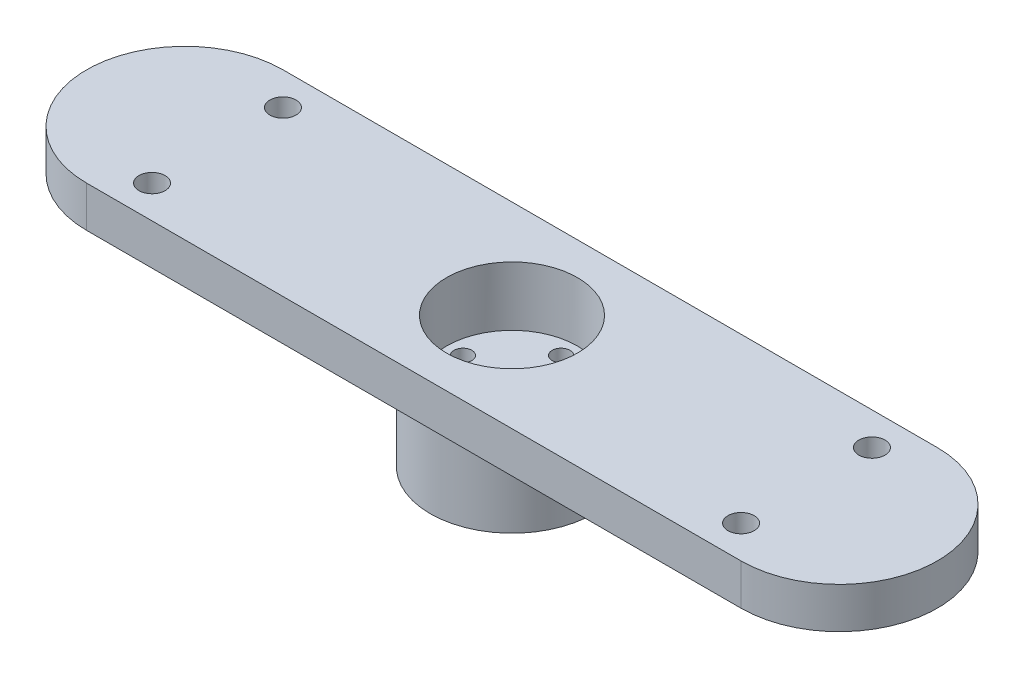
ISO-10303-21;
HEADER;
FILE_DESCRIPTION(('STEP AP214'),'2;1');
FILE_NAME('part.step','',(''),(''),'','','');
FILE_SCHEMA(('AUTOMOTIVE_DESIGN { 1 0 10303 214 1 1 1 1 }'));
ENDSEC;
DATA;
#1=APPLICATION_CONTEXT('core data for automotive mechanical design processes');
#2=APPLICATION_PROTOCOL_DEFINITION('international standard','automotive_design',2000,#1);
#3=PRODUCT_CONTEXT('',#1,'mechanical');
#4=PRODUCT('Part','Part','',(#3));
#5=PRODUCT_RELATED_PRODUCT_CATEGORY('part','',(#4));
#6=PRODUCT_DEFINITION_FORMATION('','',#4);
#7=PRODUCT_DEFINITION_CONTEXT('part definition',#1,'design');
#8=PRODUCT_DEFINITION('design','',#6,#7);
#9=PRODUCT_DEFINITION_SHAPE('','',#8);
#10=(LENGTH_UNIT() NAMED_UNIT(*) SI_UNIT(.MILLI.,.METRE.));
#11=(NAMED_UNIT(*) PLANE_ANGLE_UNIT() SI_UNIT($,.RADIAN.));
#12=(NAMED_UNIT(*) SI_UNIT($,.STERADIAN.) SOLID_ANGLE_UNIT());
#13=UNCERTAINTY_MEASURE_WITH_UNIT(LENGTH_MEASURE(1.E-05),#10,'distance_accuracy_value','');
#14=(GEOMETRIC_REPRESENTATION_CONTEXT(3) GLOBAL_UNCERTAINTY_ASSIGNED_CONTEXT((#13)) GLOBAL_UNIT_ASSIGNED_CONTEXT((#10,
#11,#12)) REPRESENTATION_CONTEXT('',''));
#15=CARTESIAN_POINT('',(0.,0.,0.));
#16=DIRECTION('',(0.,0.,1.));
#17=DIRECTION('',(1.,0.,0.));
#18=AXIS2_PLACEMENT_3D('',#15,#16,#17);
#19=CARTESIAN_POINT('',(0.,25.4,0.));
#20=DIRECTION('',(0.,-1.,0.));
#21=DIRECTION('',(0.,0.,-1.));
#22=AXIS2_PLACEMENT_3D('',#19,#20,#21);
#23=CYLINDRICAL_SURFACE('',#22,15.875);
#24=CARTESIAN_POINT('',(0.,15.0698,0.));
#25=DIRECTION('',(0.,1.,0.));
#26=DIRECTION('',(0.,0.,1.));
#27=AXIS2_PLACEMENT_3D('',#24,#25,#26);
#28=CIRCLE('',#27,15.875);
#29=CARTESIAN_POINT('',(0.,15.0698,15.875));
#30=VERTEX_POINT('',#29);
#31=EDGE_CURVE('E11',#30,#30,#28,.F.);
#32=ORIENTED_EDGE('',*,*,#31,.T.);
#33=EDGE_LOOP('',(#32));
#34=FACE_BOUND('',#33,.T.);
#35=CARTESIAN_POINT('',(0.,0.,0.));
#36=DIRECTION('',(0.,1.,0.));
#37=DIRECTION('',(0.,0.,1.));
#38=AXIS2_PLACEMENT_3D('',#35,#36,#37);
#39=CIRCLE('',#38,15.875);
#40=CARTESIAN_POINT('',(0.,0.,15.875));
#41=VERTEX_POINT('',#40);
#42=EDGE_CURVE('E137',#41,#41,#39,.T.);
#43=ORIENTED_EDGE('',*,*,#42,.T.);
#44=EDGE_LOOP('',(#43));
#45=FACE_BOUND('',#44,.T.);
#46=ADVANCED_FACE('F35',(#34,#45),#23,.T.);
#47=CARTESIAN_POINT('',(0.,25.4,0.));
#48=DIRECTION('',(0.,1.,0.));
#49=DIRECTION('',(0.,0.,1.));
#50=AXIS2_PLACEMENT_3D('',#47,#48,#49);
#51=PLANE('',#50);
#52=CARTESIAN_POINT('',(-57.15,25.4,-12.7));
#53=DIRECTION('',(0.,1.,0.));
#54=DIRECTION('',(0.,0.,-1.));
#55=AXIS2_PLACEMENT_3D('',#52,#53,#54);
#56=CIRCLE('',#55,2.54);
#57=CARTESIAN_POINT('',(-57.15,25.4,-15.24));
#58=VERTEX_POINT('',#57);
#59=EDGE_CURVE('E251',#58,#58,#56,.T.);
#60=ORIENTED_EDGE('',*,*,#59,.F.);
#61=EDGE_LOOP('',(#60));
#62=FACE_BOUND('',#61,.T.);
#63=CARTESIAN_POINT('',(-57.15,25.4,12.7));
#64=DIRECTION('',(0.,1.,0.));
#65=DIRECTION('',(0.,0.,1.));
#66=AXIS2_PLACEMENT_3D('',#63,#64,#65);
#67=CIRCLE('',#66,2.54);
#68=CARTESIAN_POINT('',(-57.15,25.4,15.24));
#69=VERTEX_POINT('',#68);
#70=EDGE_CURVE('E247',#69,#69,#67,.T.);
#71=ORIENTED_EDGE('',*,*,#70,.F.);
#72=EDGE_LOOP('',(#71));
#73=FACE_BOUND('',#72,.T.);
#74=CARTESIAN_POINT('',(57.15,25.4,12.7));
#75=DIRECTION('',(0.,1.,0.));
#76=DIRECTION('',(0.,0.,-1.));
#77=AXIS2_PLACEMENT_3D('',#74,#75,#76);
#78=CIRCLE('',#77,2.54);
#79=CARTESIAN_POINT('',(57.15,25.4,10.16));
#80=VERTEX_POINT('',#79);
#81=EDGE_CURVE('E240',#80,#80,#78,.T.);
#82=ORIENTED_EDGE('',*,*,#81,.F.);
#83=EDGE_LOOP('',(#82));
#84=FACE_BOUND('',#83,.T.);
#85=CARTESIAN_POINT('',(57.15,25.4,-12.7));
#86=DIRECTION('',(0.,1.,0.));
#87=DIRECTION('',(0.,0.,1.));
#88=AXIS2_PLACEMENT_3D('',#85,#86,#87);
#89=CIRCLE('',#88,2.54);
#90=CARTESIAN_POINT('',(57.15,25.4,-10.16));
#91=VERTEX_POINT('',#90);
#92=EDGE_CURVE('E153',#91,#91,#89,.T.);
#93=ORIENTED_EDGE('',*,*,#92,.F.);
#94=EDGE_LOOP('',(#93));
#95=FACE_BOUND('',#94,.T.);
#96=CARTESIAN_POINT('',(0.,25.4,0.));
#97=DIRECTION('',(0.,1.,0.));
#98=DIRECTION('',(0.,0.,1.));
#99=AXIS2_PLACEMENT_3D('',#96,#97,#98);
#100=CIRCLE('',#99,12.7);
#101=CARTESIAN_POINT('',(0.,25.4,12.7));
#102=VERTEX_POINT('',#101);
#103=EDGE_CURVE('E131',#102,#102,#100,.T.);
#104=ORIENTED_EDGE('',*,*,#103,.F.);
#105=EDGE_LOOP('',(#104));
#106=FACE_BOUND('',#105,.T.);
#107=DIRECTION('',(1.,0.,0.));
#108=VECTOR('',#107,1.);
#109=CARTESIAN_POINT('',(0.,25.4,19.05));
#110=LINE('',#109,#108);
#111=CARTESIAN_POINT('',(-63.5,25.4,19.05));
#112=VERTEX_POINT('',#111);
#113=CARTESIAN_POINT('',(63.5,25.4,19.05));
#114=VERTEX_POINT('',#113);
#115=EDGE_CURVE('E104',#112,#114,#110,.T.);
#116=ORIENTED_EDGE('',*,*,#115,.T.);
#117=CARTESIAN_POINT('',(63.5,25.4,0.));
#118=DIRECTION('',(0.,1.,0.));
#119=DIRECTION('',(0.,0.,1.));
#120=AXIS2_PLACEMENT_3D('',#117,#118,#119);
#121=CIRCLE('',#120,19.05);
#122=CARTESIAN_POINT('',(63.5,25.4,-19.05));
#123=VERTEX_POINT('',#122);
#124=EDGE_CURVE('E107',#114,#123,#121,.T.);
#125=ORIENTED_EDGE('',*,*,#124,.T.);
#126=DIRECTION('',(1.,0.,0.));
#127=VECTOR('',#126,1.);
#128=CARTESIAN_POINT('',(0.,25.4,-19.05));
#129=LINE('',#128,#127);
#130=CARTESIAN_POINT('',(-63.5,25.4,-19.0499999999999));
#131=VERTEX_POINT('',#130);
#132=EDGE_CURVE('E93',#131,#123,#129,.T.);
#133=ORIENTED_EDGE('',*,*,#132,.F.);
#134=CARTESIAN_POINT('',(-63.5,25.4,0.));
#135=DIRECTION('',(0.,1.,0.));
#136=DIRECTION('',(0.,0.,1.));
#137=AXIS2_PLACEMENT_3D('',#134,#135,#136);
#138=CIRCLE('',#137,19.05);
#139=EDGE_CURVE('E99',#131,#112,#138,.T.);
#140=ORIENTED_EDGE('',*,*,#139,.T.);
#141=EDGE_LOOP('',(#116,#125,#133,#140));
#142=FACE_BOUND('',#141,.T.);
#143=ADVANCED_FACE('F176',(#62,#73,#84,#95,#106,#142),#51,.T.);
#144=CARTESIAN_POINT('',(0.,0.,0.));
#145=DIRECTION('',(0.,1.,0.));
#146=DIRECTION('',(0.,0.,1.));
#147=AXIS2_PLACEMENT_3D('',#144,#145,#146);
#148=PLANE('',#147);
#149=CARTESIAN_POINT('',(-9.525,0.,0.));
#150=DIRECTION('',(0.,-1.,0.));
#151=DIRECTION('',(1.,0.,0.));
#152=AXIS2_PLACEMENT_3D('',#149,#150,#151);
#153=CIRCLE('',#152,1.7272);
#154=CARTESIAN_POINT('',(-7.7978,0.,0.));
#155=VERTEX_POINT('',#154);
#156=EDGE_CURVE('E117',#155,#155,#153,.T.);
#157=ORIENTED_EDGE('',*,*,#156,.F.);
#158=EDGE_LOOP('',(#157));
#159=FACE_BOUND('',#158,.T.);
#160=CARTESIAN_POINT('',(0.,0.,-9.525));
#161=DIRECTION('',(0.,-1.,0.));
#162=DIRECTION('',(0.,0.,1.));
#163=AXIS2_PLACEMENT_3D('',#160,#161,#162);
#164=CIRCLE('',#163,1.7272);
#165=CARTESIAN_POINT('',(0.,0.,-7.7978));
#166=VERTEX_POINT('',#165);
#167=EDGE_CURVE('E121',#166,#166,#164,.T.);
#168=ORIENTED_EDGE('',*,*,#167,.F.);
#169=EDGE_LOOP('',(#168));
#170=FACE_BOUND('',#169,.T.);
#171=CARTESIAN_POINT('',(9.525,0.,0.));
#172=DIRECTION('',(0.,-1.,0.));
#173=DIRECTION('',(-1.,0.,0.));
#174=AXIS2_PLACEMENT_3D('',#171,#172,#173);
#175=CIRCLE('',#174,1.7272);
#176=CARTESIAN_POINT('',(7.7978,0.,0.));
#177=VERTEX_POINT('',#176);
#178=EDGE_CURVE('E114',#177,#177,#175,.T.);
#179=ORIENTED_EDGE('',*,*,#178,.F.);
#180=EDGE_LOOP('',(#179));
#181=FACE_BOUND('',#180,.T.);
#182=CARTESIAN_POINT('',(0.,0.,9.525));
#183=DIRECTION('',(0.,-1.,0.));
#184=DIRECTION('',(0.,0.,-1.));
#185=AXIS2_PLACEMENT_3D('',#182,#183,#184);
#186=CIRCLE('',#185,1.7272);
#187=CARTESIAN_POINT('',(0.,0.,7.7978));
#188=VERTEX_POINT('',#187);
#189=EDGE_CURVE('E126',#188,#188,#186,.T.);
#190=ORIENTED_EDGE('',*,*,#189,.F.);
#191=EDGE_LOOP('',(#190));
#192=FACE_BOUND('',#191,.T.);
#193=ORIENTED_EDGE('',*,*,#42,.F.);
#194=EDGE_LOOP('',(#193));
#195=FACE_BOUND('',#194,.T.);
#196=ADVANCED_FACE('F181',(#159,#170,#181,#192,#195),#148,.F.);
#197=CARTESIAN_POINT('',(0.,13.90396,0.));
#198=DIRECTION('',(0.,-1.,0.));
#199=DIRECTION('',(0.,0.,-1.));
#200=AXIS2_PLACEMENT_3D('',#197,#198,#199);
#201=PLANE('',#200);
#202=CARTESIAN_POINT('',(-9.525,13.90396,0.));
#203=DIRECTION('',(0.,-1.,0.));
#204=DIRECTION('',(0.,0.,-1.));
#205=AXIS2_PLACEMENT_3D('',#202,#203,#204);
#206=CIRCLE('',#205,1.7272);
#207=CARTESIAN_POINT('',(-9.525,13.90396,-1.72720000000003));
#208=VERTEX_POINT('',#207);
#209=EDGE_CURVE('E130',#208,#208,#206,.T.);
#210=ORIENTED_EDGE('',*,*,#209,.T.);
#211=EDGE_LOOP('',(#210));
#212=FACE_BOUND('',#211,.T.);
#213=CARTESIAN_POINT('',(0.,13.90396,-9.525));
#214=DIRECTION('',(0.,-1.,0.));
#215=DIRECTION('',(0.,0.,-1.));
#216=AXIS2_PLACEMENT_3D('',#213,#214,#215);
#217=CIRCLE('',#216,1.7272);
#218=CARTESIAN_POINT('',(0.,13.90396,-11.2522));
#219=VERTEX_POINT('',#218);
#220=EDGE_CURVE('E144',#219,#219,#217,.T.);
#221=ORIENTED_EDGE('',*,*,#220,.T.);
#222=EDGE_LOOP('',(#221));
#223=FACE_BOUND('',#222,.T.);
#224=CARTESIAN_POINT('',(9.525,13.90396,0.));
#225=DIRECTION('',(0.,-1.,0.));
#226=DIRECTION('',(0.,0.,-1.));
#227=AXIS2_PLACEMENT_3D('',#224,#225,#226);
#228=CIRCLE('',#227,1.7272);
#229=CARTESIAN_POINT('',(9.525,13.90396,-1.7271999999999));
#230=VERTEX_POINT('',#229);
#231=EDGE_CURVE('E120',#230,#230,#228,.T.);
#232=ORIENTED_EDGE('',*,*,#231,.T.);
#233=EDGE_LOOP('',(#232));
#234=FACE_BOUND('',#233,.T.);
#235=CARTESIAN_POINT('',(0.,13.90396,9.525));
#236=DIRECTION('',(0.,-1.,0.));
#237=DIRECTION('',(0.,0.,-1.));
#238=AXIS2_PLACEMENT_3D('',#235,#236,#237);
#239=CIRCLE('',#238,1.7272);
#240=CARTESIAN_POINT('',(0.,13.90396,7.7978));
#241=VERTEX_POINT('',#240);
#242=EDGE_CURVE('E129',#241,#241,#239,.T.);
#243=ORIENTED_EDGE('',*,*,#242,.T.);
#244=EDGE_LOOP('',(#243));
#245=FACE_BOUND('',#244,.T.);
#246=CARTESIAN_POINT('',(0.,13.90396,0.));
#247=DIRECTION('',(0.,-1.,0.));
#248=DIRECTION('',(0.,0.,-1.));
#249=AXIS2_PLACEMENT_3D('',#246,#247,#248);
#250=CIRCLE('',#249,12.7);
#251=CARTESIAN_POINT('',(0.,13.90396,-12.7));
#252=VERTEX_POINT('',#251);
#253=EDGE_CURVE('E134',#252,#252,#250,.F.);
#254=ORIENTED_EDGE('',*,*,#253,.T.);
#255=EDGE_LOOP('',(#254));
#256=FACE_BOUND('',#255,.T.);
#257=ADVANCED_FACE('F187',(#212,#223,#234,#245,#256),#201,.F.);
#258=CARTESIAN_POINT('',(0.,-22.0170644842766,0.));
#259=DIRECTION('',(0.,1.,0.));
#260=DIRECTION('',(0.,0.,1.));
#261=AXIS2_PLACEMENT_3D('',#258,#259,#260);
#262=CYLINDRICAL_SURFACE('',#261,12.7);
#263=ORIENTED_EDGE('',*,*,#103,.T.);
#264=EDGE_LOOP('',(#263));
#265=FACE_BOUND('',#264,.T.);
#266=ORIENTED_EDGE('',*,*,#253,.F.);
#267=EDGE_LOOP('',(#266));
#268=FACE_BOUND('',#267,.T.);
#269=ADVANCED_FACE('F192',(#265,#268),#262,.F.);
#270=CARTESIAN_POINT('',(0.,25.4,9.525));
#271=DIRECTION('',(0.,-1.,0.));
#272=DIRECTION('',(0.,0.,-1.));
#273=AXIS2_PLACEMENT_3D('',#270,#271,#272);
#274=CYLINDRICAL_SURFACE('',#273,1.7272);
#275=ORIENTED_EDGE('',*,*,#189,.T.);
#276=EDGE_LOOP('',(#275));
#277=FACE_BOUND('',#276,.T.);
#278=ORIENTED_EDGE('',*,*,#242,.F.);
#279=EDGE_LOOP('',(#278));
#280=FACE_BOUND('',#279,.T.);
#281=ADVANCED_FACE('F196',(#277,#280),#274,.F.);
#282=CARTESIAN_POINT('',(9.525,25.4,0.));
#283=DIRECTION('',(0.,-1.,0.));
#284=DIRECTION('',(0.,0.,-1.));
#285=AXIS2_PLACEMENT_3D('',#282,#283,#284);
#286=CYLINDRICAL_SURFACE('',#285,1.7272);
#287=ORIENTED_EDGE('',*,*,#178,.T.);
#288=EDGE_LOOP('',(#287));
#289=FACE_BOUND('',#288,.T.);
#290=ORIENTED_EDGE('',*,*,#231,.F.);
#291=EDGE_LOOP('',(#290));
#292=FACE_BOUND('',#291,.T.);
#293=ADVANCED_FACE('F200',(#289,#292),#286,.F.);
#294=CARTESIAN_POINT('',(0.,25.4,-9.525));
#295=DIRECTION('',(0.,-1.,0.));
#296=DIRECTION('',(0.,0.,-1.));
#297=AXIS2_PLACEMENT_3D('',#294,#295,#296);
#298=CYLINDRICAL_SURFACE('',#297,1.7272);
#299=ORIENTED_EDGE('',*,*,#167,.T.);
#300=EDGE_LOOP('',(#299));
#301=FACE_BOUND('',#300,.T.);
#302=ORIENTED_EDGE('',*,*,#220,.F.);
#303=EDGE_LOOP('',(#302));
#304=FACE_BOUND('',#303,.T.);
#305=ADVANCED_FACE('F204',(#301,#304),#298,.F.);
#306=CARTESIAN_POINT('',(-9.525,25.4,0.));
#307=DIRECTION('',(0.,-1.,0.));
#308=DIRECTION('',(0.,0.,-1.));
#309=AXIS2_PLACEMENT_3D('',#306,#307,#308);
#310=CYLINDRICAL_SURFACE('',#309,1.7272);
#311=ORIENTED_EDGE('',*,*,#156,.T.);
#312=EDGE_LOOP('',(#311));
#313=FACE_BOUND('',#312,.T.);
#314=ORIENTED_EDGE('',*,*,#209,.F.);
#315=EDGE_LOOP('',(#314));
#316=FACE_BOUND('',#315,.T.);
#317=ADVANCED_FACE('F208',(#313,#316),#310,.F.);
#318=CARTESIAN_POINT('',(0.,17.4498,19.05));
#319=DIRECTION('',(0.,0.,1.));
#320=DIRECTION('',(1.,0.,0.));
#321=AXIS2_PLACEMENT_3D('',#318,#319,#320);
#322=PLANE('',#321);
#323=ORIENTED_EDGE('',*,*,#115,.F.);
#324=DIRECTION('',(0.,1.,0.));
#325=VECTOR('',#324,1.);
#326=CARTESIAN_POINT('',(-63.5,17.4498,19.05));
#327=LINE('',#326,#325);
#328=CARTESIAN_POINT('',(-63.5,17.4498,19.05));
#329=VERTEX_POINT('',#328);
#330=EDGE_CURVE('E52',#329,#112,#327,.T.);
#331=ORIENTED_EDGE('',*,*,#330,.F.);
#332=DIRECTION('',(1.,0.,0.));
#333=VECTOR('',#332,1.);
#334=CARTESIAN_POINT('',(0.,17.4498,19.05));
#335=LINE('',#334,#333);
#336=CARTESIAN_POINT('',(63.5,17.4498,19.05));
#337=VERTEX_POINT('',#336);
#338=EDGE_CURVE('E97',#329,#337,#335,.T.);
#339=ORIENTED_EDGE('',*,*,#338,.T.);
#340=DIRECTION('',(0.,1.,0.));
#341=VECTOR('',#340,1.);
#342=CARTESIAN_POINT('',(63.5,17.4498,19.05));
#343=LINE('',#342,#341);
#344=EDGE_CURVE('E80',#337,#114,#343,.T.);
#345=ORIENTED_EDGE('',*,*,#344,.T.);
#346=EDGE_LOOP('',(#323,#331,#339,#345));
#347=FACE_BOUND('',#346,.T.);
#348=ADVANCED_FACE('F212',(#347),#322,.T.);
#349=CARTESIAN_POINT('',(-63.5,17.4498,0.));
#350=DIRECTION('',(0.,1.,0.));
#351=DIRECTION('',(0.,0.,1.));
#352=AXIS2_PLACEMENT_3D('',#349,#350,#351);
#353=CYLINDRICAL_SURFACE('',#352,19.05);
#354=ORIENTED_EDGE('',*,*,#139,.F.);
#355=DIRECTION('',(0.,1.,0.));
#356=VECTOR('',#355,1.);
#357=CARTESIAN_POINT('',(-63.5,17.4498,-19.0499999999999));
#358=LINE('',#357,#356);
#359=CARTESIAN_POINT('',(-63.5,17.4498,-19.0499999999999));
#360=VERTEX_POINT('',#359);
#361=EDGE_CURVE('E69',#360,#131,#358,.T.);
#362=ORIENTED_EDGE('',*,*,#361,.F.);
#363=CARTESIAN_POINT('',(-63.5,17.4498,0.));
#364=DIRECTION('',(0.,1.,0.));
#365=DIRECTION('',(0.,0.,1.));
#366=AXIS2_PLACEMENT_3D('',#363,#364,#365);
#367=CIRCLE('',#366,19.05);
#368=EDGE_CURVE('E89',#360,#329,#367,.T.);
#369=ORIENTED_EDGE('',*,*,#368,.T.);
#370=ORIENTED_EDGE('',*,*,#330,.T.);
#371=EDGE_LOOP('',(#354,#362,#369,#370));
#372=FACE_BOUND('',#371,.T.);
#373=ADVANCED_FACE('F216',(#372),#353,.T.);
#374=CARTESIAN_POINT('',(0.,17.4498,-19.05));
#375=DIRECTION('',(0.,0.,1.));
#376=DIRECTION('',(1.,0.,0.));
#377=AXIS2_PLACEMENT_3D('',#374,#375,#376);
#378=PLANE('',#377);
#379=ORIENTED_EDGE('',*,*,#132,.T.);
#380=DIRECTION('',(0.,1.,0.));
#381=VECTOR('',#380,1.);
#382=CARTESIAN_POINT('',(63.5,17.4498,-19.05));
#383=LINE('',#382,#381);
#384=CARTESIAN_POINT('',(63.5,17.4498,-19.05));
#385=VERTEX_POINT('',#384);
#386=EDGE_CURVE('E91',#385,#123,#383,.T.);
#387=ORIENTED_EDGE('',*,*,#386,.F.);
#388=DIRECTION('',(1.,0.,0.));
#389=VECTOR('',#388,1.);
#390=CARTESIAN_POINT('',(0.,17.4498,-19.05));
#391=LINE('',#390,#389);
#392=EDGE_CURVE('E85',#360,#385,#391,.T.);
#393=ORIENTED_EDGE('',*,*,#392,.F.);
#394=ORIENTED_EDGE('',*,*,#361,.T.);
#395=EDGE_LOOP('',(#379,#387,#393,#394));
#396=FACE_BOUND('',#395,.T.);
#397=ADVANCED_FACE('F92',(#396),#378,.F.);
#398=CARTESIAN_POINT('',(63.5,17.4498,0.));
#399=DIRECTION('',(0.,1.,0.));
#400=DIRECTION('',(0.,0.,1.));
#401=AXIS2_PLACEMENT_3D('',#398,#399,#400);
#402=CYLINDRICAL_SURFACE('',#401,19.05);
#403=ORIENTED_EDGE('',*,*,#124,.F.);
#404=ORIENTED_EDGE('',*,*,#344,.F.);
#405=CARTESIAN_POINT('',(63.5,17.4498,0.));
#406=DIRECTION('',(0.,1.,0.));
#407=DIRECTION('',(0.,0.,1.));
#408=AXIS2_PLACEMENT_3D('',#405,#406,#407);
#409=CIRCLE('',#408,19.05);
#410=EDGE_CURVE('E88',#337,#385,#409,.T.);
#411=ORIENTED_EDGE('',*,*,#410,.T.);
#412=ORIENTED_EDGE('',*,*,#386,.T.);
#413=EDGE_LOOP('',(#403,#404,#411,#412));
#414=FACE_BOUND('',#413,.T.);
#415=ADVANCED_FACE('F96',(#414),#402,.T.);
#416=CARTESIAN_POINT('',(0.,17.4498,0.));
#417=DIRECTION('',(0.,1.,0.));
#418=DIRECTION('',(0.,0.,1.));
#419=AXIS2_PLACEMENT_3D('',#416,#417,#418);
#420=PLANE('',#419);
#421=CARTESIAN_POINT('',(0.,17.4498,0.));
#422=DIRECTION('',(0.,1.,0.));
#423=DIRECTION('',(0.,0.,1.));
#424=AXIS2_PLACEMENT_3D('',#421,#422,#423);
#425=CIRCLE('',#424,18.255);
#426=CARTESIAN_POINT('',(0.,17.4498,18.255));
#427=VERTEX_POINT('',#426);
#428=EDGE_CURVE('E44',#427,#427,#425,.T.);
#429=ORIENTED_EDGE('',*,*,#428,.T.);
#430=EDGE_LOOP('',(#429));
#431=FACE_BOUND('',#430,.T.);
#432=CARTESIAN_POINT('',(-57.15,17.4498,-12.7));
#433=DIRECTION('',(0.,1.,0.));
#434=DIRECTION('',(0.,0.,1.));
#435=AXIS2_PLACEMENT_3D('',#432,#433,#434);
#436=CIRCLE('',#435,2.54);
#437=CARTESIAN_POINT('',(-57.15,17.4498,-10.16));
#438=VERTEX_POINT('',#437);
#439=EDGE_CURVE('E108',#438,#438,#436,.T.);
#440=ORIENTED_EDGE('',*,*,#439,.T.);
#441=EDGE_LOOP('',(#440));
#442=FACE_BOUND('',#441,.T.);
#443=CARTESIAN_POINT('',(-57.15,17.4498,12.7));
#444=DIRECTION('',(0.,1.,0.));
#445=DIRECTION('',(0.,0.,1.));
#446=AXIS2_PLACEMENT_3D('',#443,#444,#445);
#447=CIRCLE('',#446,2.54);
#448=CARTESIAN_POINT('',(-57.15,17.4498,15.24));
#449=VERTEX_POINT('',#448);
#450=EDGE_CURVE('E156',#449,#449,#447,.T.);
#451=ORIENTED_EDGE('',*,*,#450,.T.);
#452=EDGE_LOOP('',(#451));
#453=FACE_BOUND('',#452,.T.);
#454=CARTESIAN_POINT('',(57.15,17.4498,12.7));
#455=DIRECTION('',(0.,1.,0.));
#456=DIRECTION('',(0.,0.,1.));
#457=AXIS2_PLACEMENT_3D('',#454,#455,#456);
#458=CIRCLE('',#457,2.54);
#459=CARTESIAN_POINT('',(57.15,17.4498,15.24));
#460=VERTEX_POINT('',#459);
#461=EDGE_CURVE('E152',#460,#460,#458,.T.);
#462=ORIENTED_EDGE('',*,*,#461,.T.);
#463=EDGE_LOOP('',(#462));
#464=FACE_BOUND('',#463,.T.);
#465=CARTESIAN_POINT('',(57.15,17.4498,-12.7));
#466=DIRECTION('',(0.,1.,0.));
#467=DIRECTION('',(0.,0.,1.));
#468=AXIS2_PLACEMENT_3D('',#465,#466,#467);
#469=CIRCLE('',#468,2.54);
#470=CARTESIAN_POINT('',(57.15,17.4498,-10.16));
#471=VERTEX_POINT('',#470);
#472=EDGE_CURVE('E149',#471,#471,#469,.T.);
#473=ORIENTED_EDGE('',*,*,#472,.T.);
#474=EDGE_LOOP('',(#473));
#475=FACE_BOUND('',#474,.T.);
#476=ORIENTED_EDGE('',*,*,#338,.F.);
#477=ORIENTED_EDGE('',*,*,#368,.F.);
#478=ORIENTED_EDGE('',*,*,#392,.T.);
#479=ORIENTED_EDGE('',*,*,#410,.F.);
#480=EDGE_LOOP('',(#476,#477,#478,#479));
#481=FACE_BOUND('',#480,.T.);
#482=ADVANCED_FACE('F87',(#431,#442,#453,#464,#475,#481),#420,.F.);
#483=CARTESIAN_POINT('',(57.15,0.,-12.7));
#484=DIRECTION('',(0.,1.,0.));
#485=DIRECTION('',(0.,0.,1.));
#486=AXIS2_PLACEMENT_3D('',#483,#484,#485);
#487=CYLINDRICAL_SURFACE('',#486,2.54);
#488=ORIENTED_EDGE('',*,*,#92,.T.);
#489=EDGE_LOOP('',(#488));
#490=FACE_BOUND('',#489,.T.);
#491=ORIENTED_EDGE('',*,*,#472,.F.);
#492=EDGE_LOOP('',(#491));
#493=FACE_BOUND('',#492,.T.);
#494=ADVANCED_FACE('F225',(#490,#493),#487,.F.);
#495=CARTESIAN_POINT('',(57.15,0.,12.7));
#496=DIRECTION('',(0.,1.,0.));
#497=DIRECTION('',(0.,0.,1.));
#498=AXIS2_PLACEMENT_3D('',#495,#496,#497);
#499=CYLINDRICAL_SURFACE('',#498,2.54);
#500=ORIENTED_EDGE('',*,*,#81,.T.);
#501=EDGE_LOOP('',(#500));
#502=FACE_BOUND('',#501,.T.);
#503=ORIENTED_EDGE('',*,*,#461,.F.);
#504=EDGE_LOOP('',(#503));
#505=FACE_BOUND('',#504,.T.);
#506=ADVANCED_FACE('F227',(#502,#505),#499,.F.);
#507=CARTESIAN_POINT('',(-57.15,0.,12.7));
#508=DIRECTION('',(0.,1.,0.));
#509=DIRECTION('',(0.,0.,1.));
#510=AXIS2_PLACEMENT_3D('',#507,#508,#509);
#511=CYLINDRICAL_SURFACE('',#510,2.54);
#512=ORIENTED_EDGE('',*,*,#70,.T.);
#513=EDGE_LOOP('',(#512));
#514=FACE_BOUND('',#513,.T.);
#515=ORIENTED_EDGE('',*,*,#450,.F.);
#516=EDGE_LOOP('',(#515));
#517=FACE_BOUND('',#516,.T.);
#518=ADVANCED_FACE('F171',(#514,#517),#511,.F.);
#519=CARTESIAN_POINT('',(-57.15,0.,-12.7));
#520=DIRECTION('',(0.,1.,0.));
#521=DIRECTION('',(0.,0.,1.));
#522=AXIS2_PLACEMENT_3D('',#519,#520,#521);
#523=CYLINDRICAL_SURFACE('',#522,2.54);
#524=ORIENTED_EDGE('',*,*,#59,.T.);
#525=EDGE_LOOP('',(#524));
#526=FACE_BOUND('',#525,.T.);
#527=ORIENTED_EDGE('',*,*,#439,.F.);
#528=EDGE_LOOP('',(#527));
#529=FACE_BOUND('',#528,.T.);
#530=ADVANCED_FACE('F166',(#526,#529),#523,.F.);
#531=CARTESIAN_POINT('',(0.,17.4498,0.));
#532=DIRECTION('',(0.,1.,0.));
#533=DIRECTION('',(0.,0.,1.));
#534=AXIS2_PLACEMENT_3D('',#531,#532,#533);
#535=CONICAL_SURFACE('',#534,18.255,0.785398163397455);
#536=ORIENTED_EDGE('',*,*,#31,.F.);
#537=EDGE_LOOP('',(#536));
#538=FACE_BOUND('',#537,.T.);
#539=ORIENTED_EDGE('',*,*,#428,.F.);
#540=EDGE_LOOP('',(#539));
#541=FACE_BOUND('',#540,.T.);
#542=ADVANCED_FACE('F37',(#538,#541),#535,.T.);
#543=CLOSED_SHELL('',(#46,#143,#196,#257,#269,#281,#293,#305,#317,#348,#373,#397,#415,#482,#494,
#506,#518,#530,#542));
#544=MANIFOLD_SOLID_BREP('B2',#543);
#545=ADVANCED_BREP_SHAPE_REPRESENTATION('',(#18,#544),#14);
#546=SHAPE_DEFINITION_REPRESENTATION(#9,#545);
ENDSEC;
END-ISO-10303-21;
